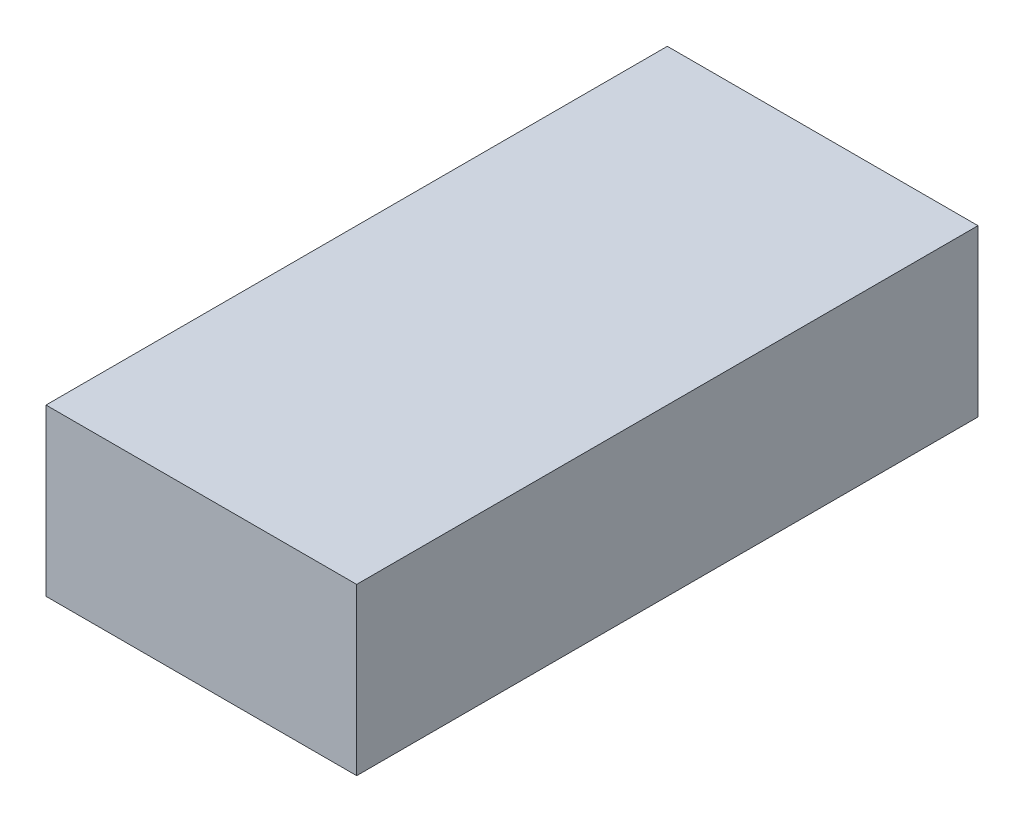
ISO-10303-21;
HEADER;
FILE_DESCRIPTION(('STEP AP214'),'2;1');
FILE_NAME('part.step','',(''),(''),'','','');
FILE_SCHEMA(('AUTOMOTIVE_DESIGN { 1 0 10303 214 1 1 1 1 }'));
ENDSEC;
DATA;
#1=APPLICATION_CONTEXT('core data for automotive mechanical design processes');
#2=APPLICATION_PROTOCOL_DEFINITION('international standard','automotive_design',2000,#1);
#3=PRODUCT_CONTEXT('',#1,'mechanical');
#4=PRODUCT('Part','Part','',(#3));
#5=PRODUCT_RELATED_PRODUCT_CATEGORY('part','',(#4));
#6=PRODUCT_DEFINITION_FORMATION('','',#4);
#7=PRODUCT_DEFINITION_CONTEXT('part definition',#1,'design');
#8=PRODUCT_DEFINITION('design','',#6,#7);
#9=PRODUCT_DEFINITION_SHAPE('','',#8);
#10=(LENGTH_UNIT() NAMED_UNIT(*) SI_UNIT(.MILLI.,.METRE.));
#11=(NAMED_UNIT(*) PLANE_ANGLE_UNIT() SI_UNIT($,.RADIAN.));
#12=(NAMED_UNIT(*) SI_UNIT($,.STERADIAN.) SOLID_ANGLE_UNIT());
#13=UNCERTAINTY_MEASURE_WITH_UNIT(LENGTH_MEASURE(1.E-05),#10,'distance_accuracy_value','');
#14=(GEOMETRIC_REPRESENTATION_CONTEXT(3) GLOBAL_UNCERTAINTY_ASSIGNED_CONTEXT((#13)) GLOBAL_UNIT_ASSIGNED_CONTEXT((#10,
#11,#12)) REPRESENTATION_CONTEXT('',''));
#15=CARTESIAN_POINT('',(0.,0.,0.));
#16=DIRECTION('',(0.,0.,1.));
#17=DIRECTION('',(1.,0.,0.));
#18=AXIS2_PLACEMENT_3D('',#15,#16,#17);
#19=CARTESIAN_POINT('',(91.7529575524537,-17.5213102037142,-22.0604415187008));
#20=DIRECTION('',(-1.,0.,0.));
#21=DIRECTION('',(0.,0.,1.));
#22=AXIS2_PLACEMENT_3D('',#19,#20,#21);
#23=PLANE('',#22);
#24=DIRECTION('',(0.,0.,-1.));
#25=VECTOR('',#24,1.);
#26=CARTESIAN_POINT('',(91.7529575524537,-29.1638633952035,-19.75965001862));
#27=LINE('',#26,#25);
#28=CARTESIAN_POINT('',(91.7529575524537,-29.1638633952035,-19.75965001862));
#29=VERTEX_POINT('',#28);
#30=CARTESIAN_POINT('',(91.7529575524537,-29.1638633952035,-25.75965001862));
#31=VERTEX_POINT('',#30);
#32=EDGE_CURVE('E26',#29,#31,#27,.T.);
#33=ORIENTED_EDGE('',*,*,#32,.T.);
#34=DIRECTION('',(0.,1.,0.));
#35=VECTOR('',#34,1.);
#36=CARTESIAN_POINT('',(91.7529575524537,-29.1638633952035,-25.75965001862));
#37=LINE('',#36,#35);
#38=CARTESIAN_POINT('',(91.7529575524537,-27.5638633952034,-25.75965001862));
#39=VERTEX_POINT('',#38);
#40=EDGE_CURVE('E103',#31,#39,#37,.T.);
#41=ORIENTED_EDGE('',*,*,#40,.T.);
#42=DIRECTION('',(0.,0.,1.));
#43=VECTOR('',#42,1.);
#44=CARTESIAN_POINT('',(91.7529575524537,-27.5638633952034,-25.75965001862));
#45=LINE('',#44,#43);
#46=CARTESIAN_POINT('',(91.7529575524537,-27.5638633952035,-19.75965001862));
#47=VERTEX_POINT('',#46);
#48=EDGE_CURVE('E19',#39,#47,#45,.T.);
#49=ORIENTED_EDGE('',*,*,#48,.T.);
#50=DIRECTION('',(0.,-1.,0.));
#51=VECTOR('',#50,1.);
#52=CARTESIAN_POINT('',(91.7529575524537,-27.5638633952035,-19.75965001862));
#53=LINE('',#52,#51);
#54=EDGE_CURVE('E93',#47,#29,#53,.T.);
#55=ORIENTED_EDGE('',*,*,#54,.T.);
#56=EDGE_LOOP('',(#33,#41,#49,#55));
#57=FACE_BOUND('',#56,.T.);
#58=ADVANCED_FACE('F16',(#57),#23,.F.);
#59=CARTESIAN_POINT('',(88.7529575524537,-17.5213102037142,-22.0604415187008));
#60=DIRECTION('',(-1.,0.,0.));
#61=DIRECTION('',(0.,0.,1.));
#62=AXIS2_PLACEMENT_3D('',#59,#60,#61);
#63=PLANE('',#62);
#64=DIRECTION('',(0.,-1.,0.));
#65=VECTOR('',#64,1.);
#66=CARTESIAN_POINT('',(88.7529575524537,-27.5638633952035,-19.7596500186201));
#67=LINE('',#66,#65);
#68=CARTESIAN_POINT('',(88.7529575524537,-27.5638633952035,-19.75965001862));
#69=VERTEX_POINT('',#68);
#70=CARTESIAN_POINT('',(88.7529575524537,-29.1638633952035,-19.7596500186201));
#71=VERTEX_POINT('',#70);
#72=EDGE_CURVE('E74',#69,#71,#67,.T.);
#73=ORIENTED_EDGE('',*,*,#72,.F.);
#74=DIRECTION('',(0.,0.,1.));
#75=VECTOR('',#74,1.);
#76=CARTESIAN_POINT('',(88.7529575524537,-27.5638633952034,-25.7596500186201));
#77=LINE('',#76,#75);
#78=CARTESIAN_POINT('',(88.7529575524537,-27.5638633952034,-25.7596500186201));
#79=VERTEX_POINT('',#78);
#80=EDGE_CURVE('E102',#79,#69,#77,.T.);
#81=ORIENTED_EDGE('',*,*,#80,.F.);
#82=DIRECTION('',(0.,1.,0.));
#83=VECTOR('',#82,1.);
#84=CARTESIAN_POINT('',(88.7529575524537,-29.1638633952035,-25.7596500186201));
#85=LINE('',#84,#83);
#86=CARTESIAN_POINT('',(88.7529575524537,-29.1638633952035,-25.7596500186201));
#87=VERTEX_POINT('',#86);
#88=EDGE_CURVE('E77',#87,#79,#85,.T.);
#89=ORIENTED_EDGE('',*,*,#88,.F.);
#90=DIRECTION('',(0.,0.,-1.));
#91=VECTOR('',#90,1.);
#92=CARTESIAN_POINT('',(88.7529575524537,-29.1638633952035,-19.7596500186201));
#93=LINE('',#92,#91);
#94=EDGE_CURVE('E11',#71,#87,#93,.T.);
#95=ORIENTED_EDGE('',*,*,#94,.F.);
#96=EDGE_LOOP('',(#73,#81,#89,#95));
#97=FACE_BOUND('',#96,.T.);
#98=ADVANCED_FACE('F71',(#97),#63,.T.);
#99=CARTESIAN_POINT('',(91.7529575524537,-29.1638633952035,-19.75965001862));
#100=DIRECTION('',(0.,-1.,0.));
#101=DIRECTION('',(0.,0.,-1.));
#102=AXIS2_PLACEMENT_3D('',#99,#100,#101);
#103=PLANE('',#102);
#104=ORIENTED_EDGE('',*,*,#32,.F.);
#105=DIRECTION('',(-1.,0.,0.));
#106=VECTOR('',#105,1.);
#107=CARTESIAN_POINT('',(91.7529575524537,-29.1638633952035,-19.75965001862));
#108=LINE('',#107,#106);
#109=EDGE_CURVE('E79',#29,#71,#108,.T.);
#110=ORIENTED_EDGE('',*,*,#109,.T.);
#111=ORIENTED_EDGE('',*,*,#94,.T.);
#112=DIRECTION('',(-1.,0.,0.));
#113=VECTOR('',#112,1.);
#114=CARTESIAN_POINT('',(91.7529575524537,-29.1638633952035,-25.75965001862));
#115=LINE('',#114,#113);
#116=EDGE_CURVE('E105',#31,#87,#115,.T.);
#117=ORIENTED_EDGE('',*,*,#116,.F.);
#118=EDGE_LOOP('',(#104,#110,#111,#117));
#119=FACE_BOUND('',#118,.T.);
#120=ADVANCED_FACE('F80',(#119),#103,.T.);
#121=CARTESIAN_POINT('',(91.7529575524537,-29.1638633952035,-25.75965001862));
#122=DIRECTION('',(0.,0.,-1.));
#123=DIRECTION('',(0.,-1.,0.));
#124=AXIS2_PLACEMENT_3D('',#121,#122,#123);
#125=PLANE('',#124);
#126=ORIENTED_EDGE('',*,*,#40,.F.);
#127=ORIENTED_EDGE('',*,*,#116,.T.);
#128=ORIENTED_EDGE('',*,*,#88,.T.);
#129=DIRECTION('',(-1.,0.,0.));
#130=VECTOR('',#129,1.);
#131=CARTESIAN_POINT('',(91.7529575524537,-27.5638633952034,-25.75965001862));
#132=LINE('',#131,#130);
#133=EDGE_CURVE('E98',#39,#79,#132,.T.);
#134=ORIENTED_EDGE('',*,*,#133,.F.);
#135=EDGE_LOOP('',(#126,#127,#128,#134));
#136=FACE_BOUND('',#135,.T.);
#137=ADVANCED_FACE('F119',(#136),#125,.T.);
#138=CARTESIAN_POINT('',(91.7529575524537,-27.5638633952034,-25.75965001862));
#139=DIRECTION('',(0.,1.,0.));
#140=DIRECTION('',(1.,0.,0.));
#141=AXIS2_PLACEMENT_3D('',#138,#139,#140);
#142=PLANE('',#141);
#143=ORIENTED_EDGE('',*,*,#48,.F.);
#144=ORIENTED_EDGE('',*,*,#133,.T.);
#145=ORIENTED_EDGE('',*,*,#80,.T.);
#146=DIRECTION('',(-1.,0.,0.));
#147=VECTOR('',#146,1.);
#148=CARTESIAN_POINT('',(91.7529575524537,-27.5638633952035,-19.75965001862));
#149=LINE('',#148,#147);
#150=EDGE_CURVE('E86',#47,#69,#149,.T.);
#151=ORIENTED_EDGE('',*,*,#150,.F.);
#152=EDGE_LOOP('',(#143,#144,#145,#151));
#153=FACE_BOUND('',#152,.T.);
#154=ADVANCED_FACE('F121',(#153),#142,.T.);
#155=CARTESIAN_POINT('',(91.7529575524537,-27.5638633952035,-19.75965001862));
#156=DIRECTION('',(0.,0.,1.));
#157=DIRECTION('',(1.,0.,0.));
#158=AXIS2_PLACEMENT_3D('',#155,#156,#157);
#159=PLANE('',#158);
#160=ORIENTED_EDGE('',*,*,#54,.F.);
#161=ORIENTED_EDGE('',*,*,#150,.T.);
#162=ORIENTED_EDGE('',*,*,#72,.T.);
#163=ORIENTED_EDGE('',*,*,#109,.F.);
#164=EDGE_LOOP('',(#160,#161,#162,#163));
#165=FACE_BOUND('',#164,.T.);
#166=ADVANCED_FACE('F85',(#165),#159,.T.);
#167=CLOSED_SHELL('',(#58,#98,#120,#137,#154,#166));
#168=MANIFOLD_SOLID_BREP('B1',#167);
#169=ADVANCED_BREP_SHAPE_REPRESENTATION('',(#18,#168),#14);
#170=SHAPE_DEFINITION_REPRESENTATION(#9,#169);
ENDSEC;
END-ISO-10303-21;
